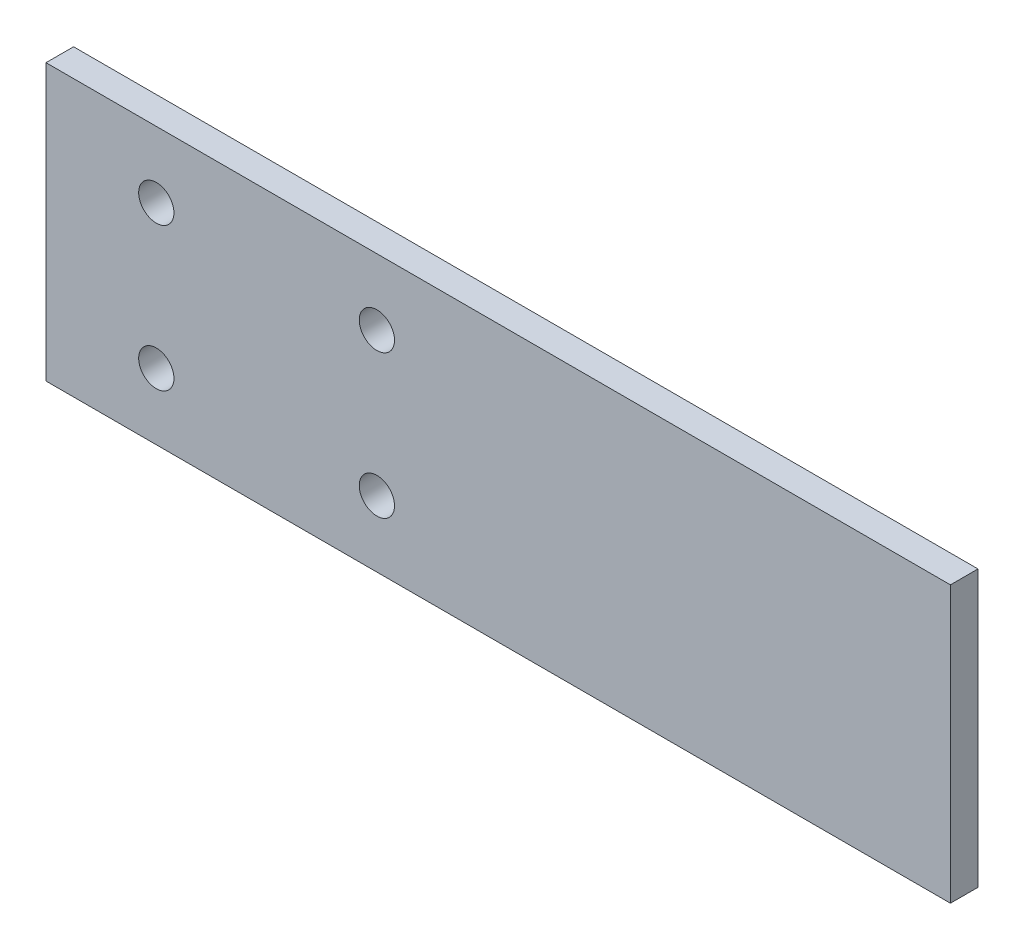
ISO-10303-21;
HEADER;
FILE_DESCRIPTION(('STEP AP214'),'2;1');
FILE_NAME('part.step','',(''),(''),'','','');
FILE_SCHEMA(('AUTOMOTIVE_DESIGN { 1 0 10303 214 1 1 1 1 }'));
ENDSEC;
DATA;
#1=APPLICATION_CONTEXT('core data for automotive mechanical design processes');
#2=APPLICATION_PROTOCOL_DEFINITION('international standard','automotive_design',2000,#1);
#3=PRODUCT_CONTEXT('',#1,'mechanical');
#4=PRODUCT('Part','Part','',(#3));
#5=PRODUCT_RELATED_PRODUCT_CATEGORY('part','',(#4));
#6=PRODUCT_DEFINITION_FORMATION('','',#4);
#7=PRODUCT_DEFINITION_CONTEXT('part definition',#1,'design');
#8=PRODUCT_DEFINITION('design','',#6,#7);
#9=PRODUCT_DEFINITION_SHAPE('','',#8);
#10=(LENGTH_UNIT() NAMED_UNIT(*) SI_UNIT(.MILLI.,.METRE.));
#11=(NAMED_UNIT(*) PLANE_ANGLE_UNIT() SI_UNIT($,.RADIAN.));
#12=(NAMED_UNIT(*) SI_UNIT($,.STERADIAN.) SOLID_ANGLE_UNIT());
#13=UNCERTAINTY_MEASURE_WITH_UNIT(LENGTH_MEASURE(1.E-05),#10,'distance_accuracy_value','');
#14=(GEOMETRIC_REPRESENTATION_CONTEXT(3) GLOBAL_UNCERTAINTY_ASSIGNED_CONTEXT((#13)) GLOBAL_UNIT_ASSIGNED_CONTEXT((#10,
#11,#12)) REPRESENTATION_CONTEXT('',''));
#15=CARTESIAN_POINT('',(0.,0.,0.));
#16=DIRECTION('',(0.,0.,1.));
#17=DIRECTION('',(1.,0.,0.));
#18=AXIS2_PLACEMENT_3D('',#15,#16,#17);
#19=CARTESIAN_POINT('',(0.,0.,2.5));
#20=DIRECTION('',(0.,0.,1.));
#21=DIRECTION('',(1.,0.,0.));
#22=AXIS2_PLACEMENT_3D('',#19,#20,#21);
#23=PLANE('',#22);
#24=CARTESIAN_POINT('',(13.84,2.91999999999999,2.5));
#25=DIRECTION('',(0.,0.,1.));
#26=DIRECTION('',(1.,0.,0.));
#27=AXIS2_PLACEMENT_3D('',#24,#25,#26);
#28=CIRCLE('',#27,1.6);
#29=CARTESIAN_POINT('',(15.44,2.91999999999999,2.5));
#30=VERTEX_POINT('',#29);
#31=EDGE_CURVE('E121',#30,#30,#28,.T.);
#32=ORIENTED_EDGE('',*,*,#31,.F.);
#33=EDGE_LOOP('',(#32));
#34=FACE_BOUND('',#33,.T.);
#35=CARTESIAN_POINT('',(-6.16000000000001,2.91999999999999,2.5));
#36=DIRECTION('',(0.,0.,1.));
#37=DIRECTION('',(1.,0.,0.));
#38=AXIS2_PLACEMENT_3D('',#35,#36,#37);
#39=CIRCLE('',#38,1.6);
#40=CARTESIAN_POINT('',(-4.56000000000001,2.91999999999999,2.5));
#41=VERTEX_POINT('',#40);
#42=EDGE_CURVE('E100',#41,#41,#39,.T.);
#43=ORIENTED_EDGE('',*,*,#42,.F.);
#44=EDGE_LOOP('',(#43));
#45=FACE_BOUND('',#44,.T.);
#46=DIRECTION('',(0.,-1.,0.));
#47=VECTOR('',#46,1.);
#48=CARTESIAN_POINT('',(-16.16,8.91999999999999,2.5));
#49=LINE('',#48,#47);
#50=CARTESIAN_POINT('',(-16.16,8.91999999999999,2.5));
#51=VERTEX_POINT('',#50);
#52=CARTESIAN_POINT('',(-16.16,-16.08,2.5));
#53=VERTEX_POINT('',#52);
#54=EDGE_CURVE('E85',#51,#53,#49,.T.);
#55=ORIENTED_EDGE('',*,*,#54,.T.);
#56=DIRECTION('',(1.,0.,0.));
#57=VECTOR('',#56,1.);
#58=CARTESIAN_POINT('',(-16.16,-16.08,2.5));
#59=LINE('',#58,#57);
#60=CARTESIAN_POINT('',(65.84,-16.08,2.5));
#61=VERTEX_POINT('',#60);
#62=EDGE_CURVE('E80',#53,#61,#59,.T.);
#63=ORIENTED_EDGE('',*,*,#62,.T.);
#64=DIRECTION('',(0.,1.,0.));
#65=VECTOR('',#64,1.);
#66=CARTESIAN_POINT('',(65.84,8.91999999999999,2.5));
#67=LINE('',#66,#65);
#68=CARTESIAN_POINT('',(65.84,8.91999999999999,2.5));
#69=VERTEX_POINT('',#68);
#70=EDGE_CURVE('E83',#61,#69,#67,.T.);
#71=ORIENTED_EDGE('',*,*,#70,.T.);
#72=DIRECTION('',(-1.,0.,0.));
#73=VECTOR('',#72,1.);
#74=CARTESIAN_POINT('',(-16.16,8.91999999999999,2.5));
#75=LINE('',#74,#73);
#76=EDGE_CURVE('E50',#69,#51,#75,.T.);
#77=ORIENTED_EDGE('',*,*,#76,.T.);
#78=EDGE_LOOP('',(#55,#63,#71,#77));
#79=FACE_BOUND('',#78,.T.);
#80=CARTESIAN_POINT('',(-6.16,-10.08,2.5));
#81=DIRECTION('',(0.,0.,1.));
#82=DIRECTION('',(1.,0.,0.));
#83=AXIS2_PLACEMENT_3D('',#80,#81,#82);
#84=CIRCLE('',#83,1.6);
#85=CARTESIAN_POINT('',(-4.56,-10.08,2.5));
#86=VERTEX_POINT('',#85);
#87=EDGE_CURVE('E115',#86,#86,#84,.T.);
#88=ORIENTED_EDGE('',*,*,#87,.F.);
#89=EDGE_LOOP('',(#88));
#90=FACE_BOUND('',#89,.T.);
#91=CARTESIAN_POINT('',(13.84,-10.08,2.5));
#92=DIRECTION('',(0.,0.,1.));
#93=DIRECTION('',(1.,0.,0.));
#94=AXIS2_PLACEMENT_3D('',#91,#92,#93);
#95=CIRCLE('',#94,1.6);
#96=CARTESIAN_POINT('',(15.44,-10.08,2.5));
#97=VERTEX_POINT('',#96);
#98=EDGE_CURVE('E127',#97,#97,#95,.T.);
#99=ORIENTED_EDGE('',*,*,#98,.F.);
#100=EDGE_LOOP('',(#99));
#101=FACE_BOUND('',#100,.T.);
#102=ADVANCED_FACE('F33',(#34,#45,#79,#90,#101),#23,.T.);
#103=CARTESIAN_POINT('',(0.,0.,0.));
#104=DIRECTION('',(0.,0.,1.));
#105=DIRECTION('',(1.,0.,0.));
#106=AXIS2_PLACEMENT_3D('',#103,#104,#105);
#107=PLANE('',#106);
#108=DIRECTION('',(0.,-1.,0.));
#109=VECTOR('',#108,1.);
#110=CARTESIAN_POINT('',(-16.16,8.91999999999999,0.));
#111=LINE('',#110,#109);
#112=CARTESIAN_POINT('',(-16.16,8.91999999999999,0.));
#113=VERTEX_POINT('',#112);
#114=CARTESIAN_POINT('',(-16.16,-16.08,0.));
#115=VERTEX_POINT('',#114);
#116=EDGE_CURVE('E97',#113,#115,#111,.T.);
#117=ORIENTED_EDGE('',*,*,#116,.F.);
#118=DIRECTION('',(-1.,0.,0.));
#119=VECTOR('',#118,1.);
#120=CARTESIAN_POINT('',(-16.16,8.91999999999999,0.));
#121=LINE('',#120,#119);
#122=CARTESIAN_POINT('',(65.84,8.91999999999999,0.));
#123=VERTEX_POINT('',#122);
#124=EDGE_CURVE('E73',#123,#113,#121,.T.);
#125=ORIENTED_EDGE('',*,*,#124,.F.);
#126=DIRECTION('',(0.,1.,0.));
#127=VECTOR('',#126,1.);
#128=CARTESIAN_POINT('',(65.84,8.91999999999999,0.));
#129=LINE('',#128,#127);
#130=CARTESIAN_POINT('',(65.84,-16.08,0.));
#131=VERTEX_POINT('',#130);
#132=EDGE_CURVE('E67',#131,#123,#129,.T.);
#133=ORIENTED_EDGE('',*,*,#132,.F.);
#134=DIRECTION('',(1.,0.,0.));
#135=VECTOR('',#134,1.);
#136=CARTESIAN_POINT('',(-16.16,-16.08,0.));
#137=LINE('',#136,#135);
#138=EDGE_CURVE('E89',#115,#131,#137,.T.);
#139=ORIENTED_EDGE('',*,*,#138,.F.);
#140=EDGE_LOOP('',(#117,#125,#133,#139));
#141=FACE_BOUND('',#140,.T.);
#142=CARTESIAN_POINT('',(-6.16000000000001,2.91999999999999,0.));
#143=DIRECTION('',(0.,0.,1.));
#144=DIRECTION('',(1.,0.,0.));
#145=AXIS2_PLACEMENT_3D('',#142,#143,#144);
#146=CIRCLE('',#145,1.6);
#147=CARTESIAN_POINT('',(-4.56000000000001,2.91999999999999,0.));
#148=VERTEX_POINT('',#147);
#149=EDGE_CURVE('E112',#148,#148,#146,.T.);
#150=ORIENTED_EDGE('',*,*,#149,.T.);
#151=EDGE_LOOP('',(#150));
#152=FACE_BOUND('',#151,.T.);
#153=CARTESIAN_POINT('',(-6.16,-10.08,0.));
#154=DIRECTION('',(0.,0.,1.));
#155=DIRECTION('',(1.,0.,0.));
#156=AXIS2_PLACEMENT_3D('',#153,#154,#155);
#157=CIRCLE('',#156,1.6);
#158=CARTESIAN_POINT('',(-4.56,-10.08,0.));
#159=VERTEX_POINT('',#158);
#160=EDGE_CURVE('E118',#159,#159,#157,.T.);
#161=ORIENTED_EDGE('',*,*,#160,.T.);
#162=EDGE_LOOP('',(#161));
#163=FACE_BOUND('',#162,.T.);
#164=CARTESIAN_POINT('',(13.84,2.91999999999999,0.));
#165=DIRECTION('',(0.,0.,1.));
#166=DIRECTION('',(1.,0.,0.));
#167=AXIS2_PLACEMENT_3D('',#164,#165,#166);
#168=CIRCLE('',#167,1.6);
#169=CARTESIAN_POINT('',(15.44,2.91999999999999,0.));
#170=VERTEX_POINT('',#169);
#171=EDGE_CURVE('E124',#170,#170,#168,.T.);
#172=ORIENTED_EDGE('',*,*,#171,.T.);
#173=EDGE_LOOP('',(#172));
#174=FACE_BOUND('',#173,.T.);
#175=CARTESIAN_POINT('',(13.84,-10.08,0.));
#176=DIRECTION('',(0.,0.,1.));
#177=DIRECTION('',(1.,0.,0.));
#178=AXIS2_PLACEMENT_3D('',#175,#176,#177);
#179=CIRCLE('',#178,1.6);
#180=CARTESIAN_POINT('',(15.44,-10.08,0.));
#181=VERTEX_POINT('',#180);
#182=EDGE_CURVE('E130',#181,#181,#179,.T.);
#183=ORIENTED_EDGE('',*,*,#182,.T.);
#184=EDGE_LOOP('',(#183));
#185=FACE_BOUND('',#184,.T.);
#186=ADVANCED_FACE('F108',(#141,#152,#163,#174,#185),#107,.F.);
#187=CARTESIAN_POINT('',(-16.16,8.91999999999999,2.5));
#188=DIRECTION('',(1.,0.,0.));
#189=DIRECTION('',(0.,1.,0.));
#190=AXIS2_PLACEMENT_3D('',#187,#188,#189);
#191=PLANE('',#190);
#192=ORIENTED_EDGE('',*,*,#116,.T.);
#193=DIRECTION('',(0.,0.,-1.));
#194=VECTOR('',#193,1.);
#195=CARTESIAN_POINT('',(-16.16,-16.08,2.5));
#196=LINE('',#195,#194);
#197=EDGE_CURVE('E11',#53,#115,#196,.T.);
#198=ORIENTED_EDGE('',*,*,#197,.F.);
#199=ORIENTED_EDGE('',*,*,#54,.F.);
#200=DIRECTION('',(0.,0.,-1.));
#201=VECTOR('',#200,1.);
#202=CARTESIAN_POINT('',(-16.16,8.91999999999999,2.5));
#203=LINE('',#202,#201);
#204=EDGE_CURVE('E93',#51,#113,#203,.T.);
#205=ORIENTED_EDGE('',*,*,#204,.T.);
#206=EDGE_LOOP('',(#192,#198,#199,#205));
#207=FACE_BOUND('',#206,.T.);
#208=ADVANCED_FACE('F35',(#207),#191,.F.);
#209=CARTESIAN_POINT('',(-16.16,-16.08,2.5));
#210=DIRECTION('',(0.,1.,0.));
#211=DIRECTION('',(0.,0.,1.));
#212=AXIS2_PLACEMENT_3D('',#209,#210,#211);
#213=PLANE('',#212);
#214=ORIENTED_EDGE('',*,*,#138,.T.);
#215=DIRECTION('',(0.,0.,-1.));
#216=VECTOR('',#215,1.);
#217=CARTESIAN_POINT('',(65.84,-16.08,2.5));
#218=LINE('',#217,#216);
#219=EDGE_CURVE('E42',#61,#131,#218,.T.);
#220=ORIENTED_EDGE('',*,*,#219,.F.);
#221=ORIENTED_EDGE('',*,*,#62,.F.);
#222=ORIENTED_EDGE('',*,*,#197,.T.);
#223=EDGE_LOOP('',(#214,#220,#221,#222));
#224=FACE_BOUND('',#223,.T.);
#225=ADVANCED_FACE('F88',(#224),#213,.F.);
#226=CARTESIAN_POINT('',(65.84,8.91999999999999,2.5));
#227=DIRECTION('',(-1.,0.,0.));
#228=DIRECTION('',(0.,0.,1.));
#229=AXIS2_PLACEMENT_3D('',#226,#227,#228);
#230=PLANE('',#229);
#231=ORIENTED_EDGE('',*,*,#132,.T.);
#232=DIRECTION('',(0.,0.,-1.));
#233=VECTOR('',#232,1.);
#234=CARTESIAN_POINT('',(65.84,8.91999999999999,2.5));
#235=LINE('',#234,#233);
#236=EDGE_CURVE('E90',#69,#123,#235,.T.);
#237=ORIENTED_EDGE('',*,*,#236,.F.);
#238=ORIENTED_EDGE('',*,*,#70,.F.);
#239=ORIENTED_EDGE('',*,*,#219,.T.);
#240=EDGE_LOOP('',(#231,#237,#238,#239));
#241=FACE_BOUND('',#240,.T.);
#242=ADVANCED_FACE('F91',(#241),#230,.F.);
#243=CARTESIAN_POINT('',(-16.16,8.91999999999999,2.5));
#244=DIRECTION('',(0.,-1.,0.));
#245=DIRECTION('',(0.,0.,-1.));
#246=AXIS2_PLACEMENT_3D('',#243,#244,#245);
#247=PLANE('',#246);
#248=ORIENTED_EDGE('',*,*,#124,.T.);
#249=ORIENTED_EDGE('',*,*,#204,.F.);
#250=ORIENTED_EDGE('',*,*,#76,.F.);
#251=ORIENTED_EDGE('',*,*,#236,.T.);
#252=EDGE_LOOP('',(#248,#249,#250,#251));
#253=FACE_BOUND('',#252,.T.);
#254=ADVANCED_FACE('F105',(#253),#247,.F.);
#255=CARTESIAN_POINT('',(-6.16000000000001,2.91999999999999,2.5));
#256=DIRECTION('',(0.,0.,-1.));
#257=DIRECTION('',(-1.,0.,0.));
#258=AXIS2_PLACEMENT_3D('',#255,#256,#257);
#259=CYLINDRICAL_SURFACE('',#258,1.6);
#260=ORIENTED_EDGE('',*,*,#42,.T.);
#261=EDGE_LOOP('',(#260));
#262=FACE_BOUND('',#261,.T.);
#263=ORIENTED_EDGE('',*,*,#149,.F.);
#264=EDGE_LOOP('',(#263));
#265=FACE_BOUND('',#264,.T.);
#266=ADVANCED_FACE('F149',(#262,#265),#259,.F.);
#267=CARTESIAN_POINT('',(-6.16,-10.08,2.5));
#268=DIRECTION('',(0.,0.,-1.));
#269=DIRECTION('',(-1.,0.,0.));
#270=AXIS2_PLACEMENT_3D('',#267,#268,#269);
#271=CYLINDRICAL_SURFACE('',#270,1.6);
#272=ORIENTED_EDGE('',*,*,#87,.T.);
#273=EDGE_LOOP('',(#272));
#274=FACE_BOUND('',#273,.T.);
#275=ORIENTED_EDGE('',*,*,#160,.F.);
#276=EDGE_LOOP('',(#275));
#277=FACE_BOUND('',#276,.T.);
#278=ADVANCED_FACE('F195',(#274,#277),#271,.F.);
#279=CARTESIAN_POINT('',(13.84,2.91999999999999,2.5));
#280=DIRECTION('',(0.,0.,-1.));
#281=DIRECTION('',(-1.,0.,0.));
#282=AXIS2_PLACEMENT_3D('',#279,#280,#281);
#283=CYLINDRICAL_SURFACE('',#282,1.6);
#284=ORIENTED_EDGE('',*,*,#31,.T.);
#285=EDGE_LOOP('',(#284));
#286=FACE_BOUND('',#285,.T.);
#287=ORIENTED_EDGE('',*,*,#171,.F.);
#288=EDGE_LOOP('',(#287));
#289=FACE_BOUND('',#288,.T.);
#290=ADVANCED_FACE('F203',(#286,#289),#283,.F.);
#291=CARTESIAN_POINT('',(13.84,-10.08,2.5));
#292=DIRECTION('',(0.,0.,-1.));
#293=DIRECTION('',(-1.,0.,0.));
#294=AXIS2_PLACEMENT_3D('',#291,#292,#293);
#295=CYLINDRICAL_SURFACE('',#294,1.6);
#296=ORIENTED_EDGE('',*,*,#98,.T.);
#297=EDGE_LOOP('',(#296));
#298=FACE_BOUND('',#297,.T.);
#299=ORIENTED_EDGE('',*,*,#182,.F.);
#300=EDGE_LOOP('',(#299));
#301=FACE_BOUND('',#300,.T.);
#302=ADVANCED_FACE('F136',(#298,#301),#295,.F.);
#303=CLOSED_SHELL('',(#102,#186,#208,#225,#242,#254,#266,#278,#290,#302));
#304=MANIFOLD_SOLID_BREP('B2',#303);
#305=ADVANCED_BREP_SHAPE_REPRESENTATION('',(#18,#304),#14);
#306=SHAPE_DEFINITION_REPRESENTATION(#9,#305);
ENDSEC;
END-ISO-10303-21;
